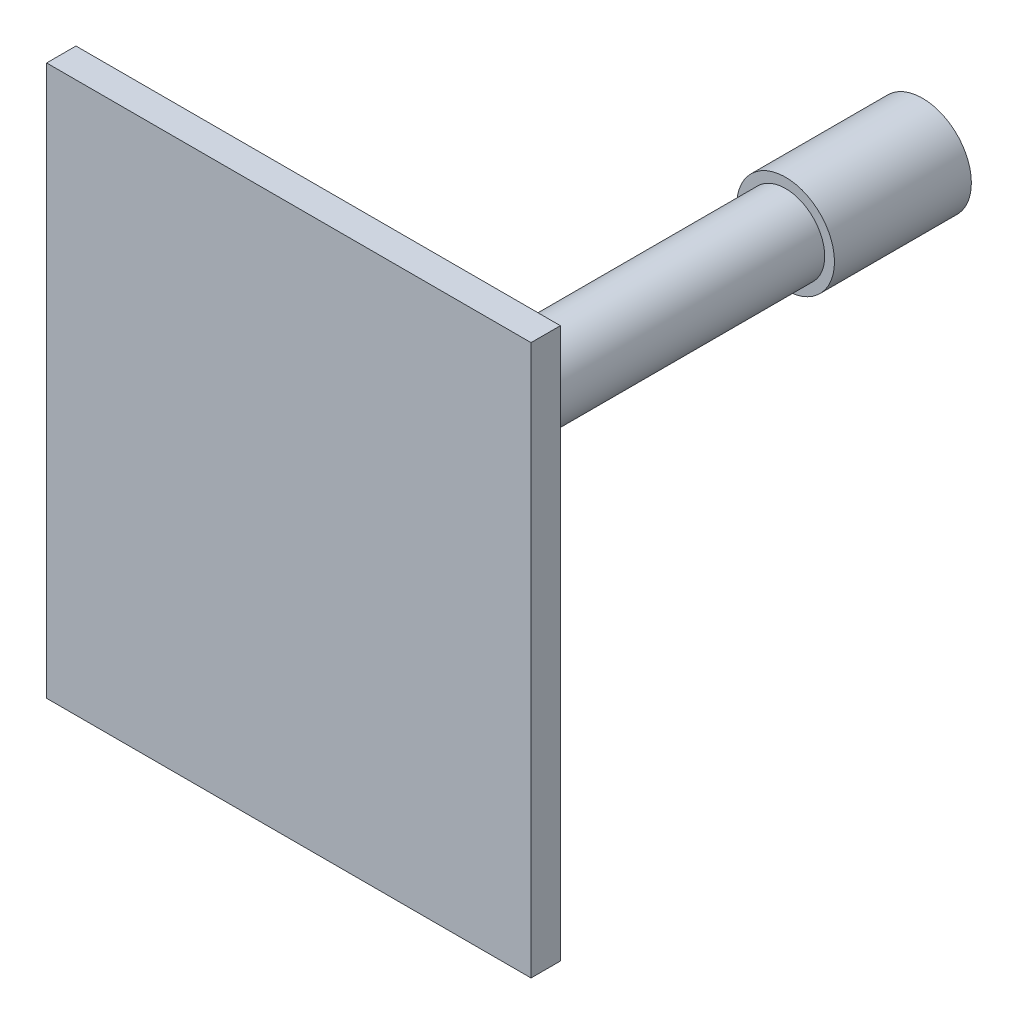
ISO-10303-21;
HEADER;
FILE_DESCRIPTION(('STEP AP214'),'2;1');
FILE_NAME('part.step','',(''),(''),'','','');
FILE_SCHEMA(('AUTOMOTIVE_DESIGN { 1 0 10303 214 1 1 1 1 }'));
ENDSEC;
DATA;
#1=APPLICATION_CONTEXT('core data for automotive mechanical design processes');
#2=APPLICATION_PROTOCOL_DEFINITION('international standard','automotive_design',2000,#1);
#3=PRODUCT_CONTEXT('',#1,'mechanical');
#4=PRODUCT('Part','Part','',(#3));
#5=PRODUCT_RELATED_PRODUCT_CATEGORY('part','',(#4));
#6=PRODUCT_DEFINITION_FORMATION('','',#4);
#7=PRODUCT_DEFINITION_CONTEXT('part definition',#1,'design');
#8=PRODUCT_DEFINITION('design','',#6,#7);
#9=PRODUCT_DEFINITION_SHAPE('','',#8);
#10=(LENGTH_UNIT() NAMED_UNIT(*) SI_UNIT(.MILLI.,.METRE.));
#11=(NAMED_UNIT(*) PLANE_ANGLE_UNIT() SI_UNIT($,.RADIAN.));
#12=(NAMED_UNIT(*) SI_UNIT($,.STERADIAN.) SOLID_ANGLE_UNIT());
#13=UNCERTAINTY_MEASURE_WITH_UNIT(LENGTH_MEASURE(1.E-05),#10,'distance_accuracy_value','');
#14=(GEOMETRIC_REPRESENTATION_CONTEXT(3) GLOBAL_UNCERTAINTY_ASSIGNED_CONTEXT((#13)) GLOBAL_UNIT_ASSIGNED_CONTEXT((#10,
#11,#12)) REPRESENTATION_CONTEXT('',''));
#15=CARTESIAN_POINT('',(0.,0.,0.));
#16=DIRECTION('',(0.,0.,1.));
#17=DIRECTION('',(1.,0.,0.));
#18=AXIS2_PLACEMENT_3D('',#15,#16,#17);
#19=CARTESIAN_POINT('',(0.,0.,44.45));
#20=DIRECTION('',(0.,0.,-1.));
#21=DIRECTION('',(-1.,0.,0.));
#22=AXIS2_PLACEMENT_3D('',#19,#20,#21);
#23=CYLINDRICAL_SURFACE('',#22,15.875);
#24=CARTESIAN_POINT('',(0.,0.,44.45));
#25=DIRECTION('',(0.,0.,1.));
#26=DIRECTION('',(1.,0.,0.));
#27=AXIS2_PLACEMENT_3D('',#24,#25,#26);
#28=CIRCLE('',#27,15.875);
#29=CARTESIAN_POINT('',(15.875,0.,44.45));
#30=VERTEX_POINT('',#29);
#31=EDGE_CURVE('E145',#30,#30,#28,.T.);
#32=ORIENTED_EDGE('',*,*,#31,.F.);
#33=EDGE_LOOP('',(#32));
#34=FACE_BOUND('',#33,.T.);
#35=CARTESIAN_POINT('',(0.,0.,0.));
#36=DIRECTION('',(0.,0.,1.));
#37=DIRECTION('',(1.,0.,0.));
#38=AXIS2_PLACEMENT_3D('',#35,#36,#37);
#39=CIRCLE('',#38,15.875);
#40=CARTESIAN_POINT('',(15.875,0.,0.));
#41=VERTEX_POINT('',#40);
#42=EDGE_CURVE('E141',#41,#41,#39,.T.);
#43=ORIENTED_EDGE('',*,*,#42,.T.);
#44=EDGE_LOOP('',(#43));
#45=FACE_BOUND('',#44,.T.);
#46=ADVANCED_FACE('F39',(#34,#45),#23,.T.);
#47=CARTESIAN_POINT('',(0.,0.,44.45));
#48=DIRECTION('',(0.,0.,1.));
#49=DIRECTION('',(1.,0.,0.));
#50=AXIS2_PLACEMENT_3D('',#47,#48,#49);
#51=PLANE('',#50);
#52=CARTESIAN_POINT('',(0.,0.,44.45));
#53=DIRECTION('',(0.,0.,1.));
#54=DIRECTION('',(1.,0.,0.));
#55=AXIS2_PLACEMENT_3D('',#52,#53,#54);
#56=CIRCLE('',#55,12.7);
#57=CARTESIAN_POINT('',(12.7,0.,44.45));
#58=VERTEX_POINT('',#57);
#59=EDGE_CURVE('E49',#58,#58,#56,.T.);
#60=ORIENTED_EDGE('',*,*,#59,.F.);
#61=EDGE_LOOP('',(#60));
#62=FACE_BOUND('',#61,.T.);
#63=ORIENTED_EDGE('',*,*,#31,.T.);
#64=EDGE_LOOP('',(#63));
#65=FACE_BOUND('',#64,.T.);
#66=ADVANCED_FACE('F156',(#62,#65),#51,.T.);
#67=CARTESIAN_POINT('',(0.,0.,0.));
#68=DIRECTION('',(0.,0.,1.));
#69=DIRECTION('',(1.,0.,0.));
#70=AXIS2_PLACEMENT_3D('',#67,#68,#69);
#71=PLANE('',#70);
#72=CARTESIAN_POINT('',(0.,0.,0.));
#73=DIRECTION('',(0.,0.,-1.));
#74=DIRECTION('',(-1.,0.,0.));
#75=AXIS2_PLACEMENT_3D('',#72,#73,#74);
#76=CIRCLE('',#75,5.55625);
#77=CARTESIAN_POINT('',(-5.55625,0.,0.));
#78=VERTEX_POINT('',#77);
#79=EDGE_CURVE('E129',#78,#78,#76,.T.);
#80=ORIENTED_EDGE('',*,*,#79,.F.);
#81=EDGE_LOOP('',(#80));
#82=FACE_BOUND('',#81,.T.);
#83=ORIENTED_EDGE('',*,*,#42,.F.);
#84=EDGE_LOOP('',(#83));
#85=FACE_BOUND('',#84,.T.);
#86=ADVANCED_FACE('F153',(#82,#85),#71,.F.);
#87=CARTESIAN_POINT('',(0.,0.,158.115));
#88=DIRECTION('',(0.,0.,-1.));
#89=DIRECTION('',(-1.,0.,0.));
#90=AXIS2_PLACEMENT_3D('',#87,#88,#89);
#91=CYLINDRICAL_SURFACE('',#90,12.7);
#92=CARTESIAN_POINT('',(0.,0.,158.115));
#93=DIRECTION('',(0.,0.,1.));
#94=DIRECTION('',(1.,0.,0.));
#95=AXIS2_PLACEMENT_3D('',#92,#93,#94);
#96=CIRCLE('',#95,12.7);
#97=CARTESIAN_POINT('',(12.7,0.,158.115));
#98=VERTEX_POINT('',#97);
#99=EDGE_CURVE('E136',#98,#98,#96,.T.);
#100=ORIENTED_EDGE('',*,*,#99,.F.);
#101=EDGE_LOOP('',(#100));
#102=FACE_BOUND('',#101,.T.);
#103=ORIENTED_EDGE('',*,*,#59,.T.);
#104=EDGE_LOOP('',(#103));
#105=FACE_BOUND('',#104,.T.);
#106=ADVANCED_FACE('F155',(#102,#105),#91,.T.);
#107=CARTESIAN_POINT('',(0.,0.,158.115));
#108=DIRECTION('',(0.,0.,1.));
#109=DIRECTION('',(1.,0.,0.));
#110=AXIS2_PLACEMENT_3D('',#107,#108,#109);
#111=PLANE('',#110);
#112=CARTESIAN_POINT('',(0.,0.,158.115));
#113=DIRECTION('',(0.,0.,1.));
#114=DIRECTION('',(1.,0.,0.));
#115=AXIS2_PLACEMENT_3D('',#112,#113,#114);
#116=CIRCLE('',#115,11.01725);
#117=CARTESIAN_POINT('',(11.01725,0.,158.115));
#118=VERTEX_POINT('',#117);
#119=EDGE_CURVE('E11',#118,#118,#116,.T.);
#120=ORIENTED_EDGE('',*,*,#119,.F.);
#121=EDGE_LOOP('',(#120));
#122=FACE_BOUND('',#121,.T.);
#123=ORIENTED_EDGE('',*,*,#99,.T.);
#124=EDGE_LOOP('',(#123));
#125=FACE_BOUND('',#124,.T.);
#126=ADVANCED_FACE('F163',(#122,#125),#111,.T.);
#127=CARTESIAN_POINT('',(0.,0.,196.215));
#128=DIRECTION('',(0.,0.,-1.));
#129=DIRECTION('',(-1.,0.,0.));
#130=AXIS2_PLACEMENT_3D('',#127,#128,#129);
#131=CYLINDRICAL_SURFACE('',#130,11.01725);
#132=CARTESIAN_POINT('',(0.,0.,196.215));
#133=DIRECTION('',(0.,0.,1.));
#134=DIRECTION('',(1.,0.,0.));
#135=AXIS2_PLACEMENT_3D('',#132,#133,#134);
#136=CIRCLE('',#135,11.01725);
#137=CARTESIAN_POINT('',(11.01725,0.,196.215));
#138=VERTEX_POINT('',#137);
#139=EDGE_CURVE('E133',#138,#138,#136,.T.);
#140=ORIENTED_EDGE('',*,*,#139,.F.);
#141=EDGE_LOOP('',(#140));
#142=FACE_BOUND('',#141,.T.);
#143=ORIENTED_EDGE('',*,*,#119,.T.);
#144=EDGE_LOOP('',(#143));
#145=FACE_BOUND('',#144,.T.);
#146=ADVANCED_FACE('F194',(#142,#145),#131,.T.);
#147=CARTESIAN_POINT('',(0.,0.,215.9));
#148=DIRECTION('',(0.,0.,-1.));
#149=DIRECTION('',(-1.,0.,0.));
#150=AXIS2_PLACEMENT_3D('',#147,#148,#149);
#151=CYLINDRICAL_SURFACE('',#150,5.55625);
#152=CARTESIAN_POINT('',(0.,0.,196.215));
#153=DIRECTION('',(0.,0.,1.));
#154=DIRECTION('',(1.,0.,0.));
#155=AXIS2_PLACEMENT_3D('',#152,#153,#154);
#156=CIRCLE('',#155,5.55625);
#157=CARTESIAN_POINT('',(5.55625,0.,196.215));
#158=VERTEX_POINT('',#157);
#159=EDGE_CURVE('E42',#158,#158,#156,.T.);
#160=ORIENTED_EDGE('',*,*,#159,.T.);
#161=EDGE_LOOP('',(#160));
#162=FACE_BOUND('',#161,.T.);
#163=ORIENTED_EDGE('',*,*,#79,.T.);
#164=EDGE_LOOP('',(#163));
#165=FACE_BOUND('',#164,.T.);
#166=ADVANCED_FACE('F201',(#162,#165),#151,.F.);
#167=CARTESIAN_POINT('',(0.,0.,196.215));
#168=DIRECTION('',(0.,0.,1.));
#169=DIRECTION('',(1.,0.,0.));
#170=AXIS2_PLACEMENT_3D('',#167,#168,#169);
#171=PLANE('',#170);
#172=ORIENTED_EDGE('',*,*,#139,.T.);
#173=EDGE_LOOP('',(#172));
#174=FACE_BOUND('',#173,.T.);
#175=DIRECTION('',(0.,1.,0.));
#176=VECTOR('',#175,1.);
#177=CARTESIAN_POINT('',(78.6427992830787,89.3315111834312,196.215));
#178=LINE('',#177,#176);
#179=CARTESIAN_POINT('',(78.6427992830787,-89.3315111834312,196.215));
#180=VERTEX_POINT('',#179);
#181=CARTESIAN_POINT('',(78.6427992830787,89.3315111834312,196.215));
#182=VERTEX_POINT('',#181);
#183=EDGE_CURVE('E113',#180,#182,#178,.T.);
#184=ORIENTED_EDGE('',*,*,#183,.F.);
#185=DIRECTION('',(1.,0.,0.));
#186=VECTOR('',#185,1.);
#187=CARTESIAN_POINT('',(-78.6427992830787,-89.3315111834312,196.215));
#188=LINE('',#187,#186);
#189=CARTESIAN_POINT('',(-78.6427992830787,-89.3315111834312,196.215));
#190=VERTEX_POINT('',#189);
#191=EDGE_CURVE('E81',#190,#180,#188,.T.);
#192=ORIENTED_EDGE('',*,*,#191,.F.);
#193=DIRECTION('',(0.,-1.,0.));
#194=VECTOR('',#193,1.);
#195=CARTESIAN_POINT('',(-78.6427992830787,89.3315111834312,196.215));
#196=LINE('',#195,#194);
#197=CARTESIAN_POINT('',(-78.6427992830787,89.3315111834312,196.215));
#198=VERTEX_POINT('',#197);
#199=EDGE_CURVE('E75',#198,#190,#196,.T.);
#200=ORIENTED_EDGE('',*,*,#199,.F.);
#201=DIRECTION('',(-1.,0.,0.));
#202=VECTOR('',#201,1.);
#203=CARTESIAN_POINT('',(-78.6427992830787,89.3315111834312,196.215));
#204=LINE('',#203,#202);
#205=EDGE_CURVE('E100',#182,#198,#204,.T.);
#206=ORIENTED_EDGE('',*,*,#205,.F.);
#207=EDGE_LOOP('',(#184,#192,#200,#206));
#208=FACE_BOUND('',#207,.T.);
#209=ADVANCED_FACE('F208',(#174,#208),#171,.F.);
#210=CARTESIAN_POINT('',(0.,0.,205.74));
#211=DIRECTION('',(0.,0.,1.));
#212=DIRECTION('',(1.,0.,0.));
#213=AXIS2_PLACEMENT_3D('',#210,#211,#212);
#214=PLANE('',#213);
#215=DIRECTION('',(0.,1.,0.));
#216=VECTOR('',#215,1.);
#217=CARTESIAN_POINT('',(78.6427992830787,89.3315111834312,205.74));
#218=LINE('',#217,#216);
#219=CARTESIAN_POINT('',(78.6427992830787,-89.3315111834312,205.74));
#220=VERTEX_POINT('',#219);
#221=CARTESIAN_POINT('',(78.6427992830787,89.3315111834312,205.74));
#222=VERTEX_POINT('',#221);
#223=EDGE_CURVE('E94',#220,#222,#218,.T.);
#224=ORIENTED_EDGE('',*,*,#223,.T.);
#225=DIRECTION('',(-1.,0.,0.));
#226=VECTOR('',#225,1.);
#227=CARTESIAN_POINT('',(-78.6427992830787,89.3315111834312,205.74));
#228=LINE('',#227,#226);
#229=CARTESIAN_POINT('',(-78.6427992830787,89.3315111834312,205.74));
#230=VERTEX_POINT('',#229);
#231=EDGE_CURVE('E89',#222,#230,#228,.T.);
#232=ORIENTED_EDGE('',*,*,#231,.T.);
#233=DIRECTION('',(0.,-1.,0.));
#234=VECTOR('',#233,1.);
#235=CARTESIAN_POINT('',(-78.6427992830787,89.3315111834312,205.74));
#236=LINE('',#235,#234);
#237=CARTESIAN_POINT('',(-78.6427992830787,-89.3315111834312,205.74));
#238=VERTEX_POINT('',#237);
#239=EDGE_CURVE('E92',#230,#238,#236,.T.);
#240=ORIENTED_EDGE('',*,*,#239,.T.);
#241=DIRECTION('',(1.,0.,0.));
#242=VECTOR('',#241,1.);
#243=CARTESIAN_POINT('',(-78.6427992830787,-89.3315111834312,205.74));
#244=LINE('',#243,#242);
#245=EDGE_CURVE('E58',#238,#220,#244,.T.);
#246=ORIENTED_EDGE('',*,*,#245,.T.);
#247=EDGE_LOOP('',(#224,#232,#240,#246));
#248=FACE_BOUND('',#247,.T.);
#249=ADVANCED_FACE('F90',(#248),#214,.T.);
#250=CARTESIAN_POINT('',(-78.6427992830787,-89.3315111834312,205.74));
#251=DIRECTION('',(0.,1.,0.));
#252=DIRECTION('',(0.,0.,1.));
#253=AXIS2_PLACEMENT_3D('',#250,#251,#252);
#254=PLANE('',#253);
#255=ORIENTED_EDGE('',*,*,#191,.T.);
#256=DIRECTION('',(0.,0.,-1.));
#257=VECTOR('',#256,1.);
#258=CARTESIAN_POINT('',(78.6427992830787,-89.3315111834312,205.74));
#259=LINE('',#258,#257);
#260=EDGE_CURVE('E109',#220,#180,#259,.T.);
#261=ORIENTED_EDGE('',*,*,#260,.F.);
#262=ORIENTED_EDGE('',*,*,#245,.F.);
#263=DIRECTION('',(0.,0.,-1.));
#264=VECTOR('',#263,1.);
#265=CARTESIAN_POINT('',(-78.6427992830787,-89.3315111834312,205.74));
#266=LINE('',#265,#264);
#267=EDGE_CURVE('E103',#238,#190,#266,.T.);
#268=ORIENTED_EDGE('',*,*,#267,.T.);
#269=EDGE_LOOP('',(#255,#261,#262,#268));
#270=FACE_BOUND('',#269,.T.);
#271=ADVANCED_FACE('F224',(#270),#254,.F.);
#272=CARTESIAN_POINT('',(-78.6427992830787,89.3315111834312,205.74));
#273=DIRECTION('',(1.,0.,0.));
#274=DIRECTION('',(0.,0.,-1.));
#275=AXIS2_PLACEMENT_3D('',#272,#273,#274);
#276=PLANE('',#275);
#277=ORIENTED_EDGE('',*,*,#199,.T.);
#278=ORIENTED_EDGE('',*,*,#267,.F.);
#279=ORIENTED_EDGE('',*,*,#239,.F.);
#280=DIRECTION('',(0.,0.,-1.));
#281=VECTOR('',#280,1.);
#282=CARTESIAN_POINT('',(-78.6427992830787,89.3315111834312,205.74));
#283=LINE('',#282,#281);
#284=EDGE_CURVE('E98',#230,#198,#283,.T.);
#285=ORIENTED_EDGE('',*,*,#284,.T.);
#286=EDGE_LOOP('',(#277,#278,#279,#285));
#287=FACE_BOUND('',#286,.T.);
#288=ADVANCED_FACE('F105',(#287),#276,.F.);
#289=CARTESIAN_POINT('',(-78.6427992830787,89.3315111834312,205.74));
#290=DIRECTION('',(0.,-1.,0.));
#291=DIRECTION('',(0.,0.,-1.));
#292=AXIS2_PLACEMENT_3D('',#289,#290,#291);
#293=PLANE('',#292);
#294=ORIENTED_EDGE('',*,*,#205,.T.);
#295=ORIENTED_EDGE('',*,*,#284,.F.);
#296=ORIENTED_EDGE('',*,*,#231,.F.);
#297=DIRECTION('',(0.,0.,-1.));
#298=VECTOR('',#297,1.);
#299=CARTESIAN_POINT('',(78.6427992830787,89.3315111834312,205.74));
#300=LINE('',#299,#298);
#301=EDGE_CURVE('E102',#222,#182,#300,.T.);
#302=ORIENTED_EDGE('',*,*,#301,.T.);
#303=EDGE_LOOP('',(#294,#295,#296,#302));
#304=FACE_BOUND('',#303,.T.);
#305=ADVANCED_FACE('F99',(#304),#293,.F.);
#306=CARTESIAN_POINT('',(78.6427992830787,89.3315111834312,205.74));
#307=DIRECTION('',(-1.,0.,0.));
#308=DIRECTION('',(0.,0.,1.));
#309=AXIS2_PLACEMENT_3D('',#306,#307,#308);
#310=PLANE('',#309);
#311=ORIENTED_EDGE('',*,*,#183,.T.);
#312=ORIENTED_EDGE('',*,*,#301,.F.);
#313=ORIENTED_EDGE('',*,*,#223,.F.);
#314=ORIENTED_EDGE('',*,*,#260,.T.);
#315=EDGE_LOOP('',(#311,#312,#313,#314));
#316=FACE_BOUND('',#315,.T.);
#317=ADVANCED_FACE('F243',(#316),#310,.F.);
#318=ORIENTED_EDGE('',*,*,#159,.F.);
#319=EDGE_LOOP('',(#318));
#320=FACE_BOUND('',#319,.T.);
#321=ADVANCED_FACE('F218',(#320),#171,.F.);
#322=CLOSED_SHELL('',(#46,#66,#86,#106,#126,#146,#166,#209,#249,#271,#288,#305,#317,#321));
#323=MANIFOLD_SOLID_BREP('B2',#322);
#324=ADVANCED_BREP_SHAPE_REPRESENTATION('',(#18,#323),#14);
#325=SHAPE_DEFINITION_REPRESENTATION(#9,#324);
ENDSEC;
END-ISO-10303-21;
